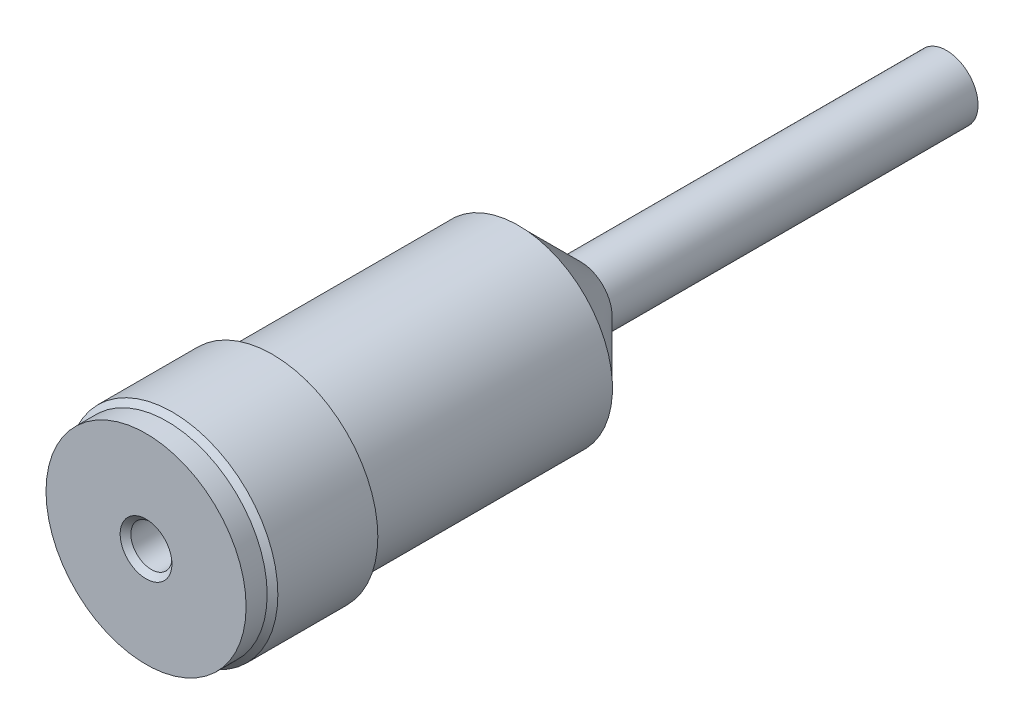
ISO-10303-21;
HEADER;
FILE_DESCRIPTION(('STEP AP214'),'2;1');
FILE_NAME('part.step','',(''),(''),'','','');
FILE_SCHEMA(('AUTOMOTIVE_DESIGN { 1 0 10303 214 1 1 1 1 }'));
ENDSEC;
DATA;
#1=APPLICATION_CONTEXT('core data for automotive mechanical design processes');
#2=APPLICATION_PROTOCOL_DEFINITION('international standard','automotive_design',2000,#1);
#3=PRODUCT_CONTEXT('',#1,'mechanical');
#4=PRODUCT('Part','Part','',(#3));
#5=PRODUCT_RELATED_PRODUCT_CATEGORY('part','',(#4));
#6=PRODUCT_DEFINITION_FORMATION('','',#4);
#7=PRODUCT_DEFINITION_CONTEXT('part definition',#1,'design');
#8=PRODUCT_DEFINITION('design','',#6,#7);
#9=PRODUCT_DEFINITION_SHAPE('','',#8);
#10=(LENGTH_UNIT() NAMED_UNIT(*) SI_UNIT(.MILLI.,.METRE.));
#11=(NAMED_UNIT(*) PLANE_ANGLE_UNIT() SI_UNIT($,.RADIAN.));
#12=(NAMED_UNIT(*) SI_UNIT($,.STERADIAN.) SOLID_ANGLE_UNIT());
#13=UNCERTAINTY_MEASURE_WITH_UNIT(LENGTH_MEASURE(1.E-05),#10,'distance_accuracy_value','');
#14=(GEOMETRIC_REPRESENTATION_CONTEXT(3) GLOBAL_UNCERTAINTY_ASSIGNED_CONTEXT((#13)) GLOBAL_UNIT_ASSIGNED_CONTEXT((#10,
#11,#12)) REPRESENTATION_CONTEXT('',''));
#15=CARTESIAN_POINT('',(0.,0.,0.));
#16=DIRECTION('',(0.,0.,1.));
#17=DIRECTION('',(1.,0.,0.));
#18=AXIS2_PLACEMENT_3D('',#15,#16,#17);
#19=CARTESIAN_POINT('',(0.,0.,-16.68));
#20=DIRECTION('',(0.,0.,-1.));
#21=DIRECTION('',(-1.,0.,0.));
#22=AXIS2_PLACEMENT_3D('',#19,#20,#21);
#23=PLANE('',#22);
#24=CARTESIAN_POINT('',(0.,0.,-16.68));
#25=DIRECTION('',(0.,0.,-1.));
#26=DIRECTION('',(-1.,0.,0.));
#27=AXIS2_PLACEMENT_3D('',#24,#25,#26);
#28=CIRCLE('',#27,4.4464);
#29=CARTESIAN_POINT('',(-4.4464,0.,-16.68));
#30=VERTEX_POINT('',#29);
#31=EDGE_CURVE('E239',#30,#30,#28,.F.);
#32=ORIENTED_EDGE('',*,*,#31,.T.);
#33=EDGE_LOOP('',(#32));
#34=FACE_BOUND('',#33,.T.);
#35=CARTESIAN_POINT('',(0.,0.,-16.68));
#36=DIRECTION('',(0.,0.,-1.));
#37=DIRECTION('',(-1.,0.,0.));
#38=AXIS2_PLACEMENT_3D('',#35,#36,#37);
#39=CIRCLE('',#38,4.463800064);
#40=CARTESIAN_POINT('',(-4.463800064,0.,-16.68));
#41=VERTEX_POINT('',#40);
#42=EDGE_CURVE('E215',#41,#41,#39,.T.);
#43=ORIENTED_EDGE('',*,*,#42,.T.);
#44=EDGE_LOOP('',(#43));
#45=FACE_BOUND('',#44,.T.);
#46=ADVANCED_FACE('F34',(#34,#45),#23,.T.);
#47=CARTESIAN_POINT('',(0.,0.,-16.68));
#48=DIRECTION('',(0.,0.,-1.));
#49=DIRECTION('',(-1.,0.,0.));
#50=AXIS2_PLACEMENT_3D('',#47,#48,#49);
#51=CYLINDRICAL_SURFACE('',#50,1.5);
#52=CARTESIAN_POINT('',(0.,0.,-19.6264));
#53=DIRECTION('',(0.,0.,-1.));
#54=DIRECTION('',(-1.,0.,0.));
#55=AXIS2_PLACEMENT_3D('',#52,#53,#54);
#56=CIRCLE('',#55,1.5);
#57=CARTESIAN_POINT('',(-1.5,0.,-19.6264));
#58=VERTEX_POINT('',#57);
#59=EDGE_CURVE('E85',#58,#58,#56,.T.);
#60=ORIENTED_EDGE('',*,*,#59,.T.);
#61=EDGE_LOOP('',(#60));
#62=FACE_BOUND('',#61,.T.);
#63=CARTESIAN_POINT('',(0.,0.,-37.));
#64=DIRECTION('',(0.,0.,-1.));
#65=DIRECTION('',(-1.,0.,0.));
#66=AXIS2_PLACEMENT_3D('',#63,#64,#65);
#67=CIRCLE('',#66,1.5);
#68=CARTESIAN_POINT('',(-1.5,0.,-37.));
#69=VERTEX_POINT('',#68);
#70=EDGE_CURVE('E138',#69,#69,#67,.T.);
#71=ORIENTED_EDGE('',*,*,#70,.F.);
#72=EDGE_LOOP('',(#71));
#73=FACE_BOUND('',#72,.T.);
#74=ADVANCED_FACE('F121',(#62,#73),#51,.T.);
#75=CARTESIAN_POINT('',(0.,0.,-37.));
#76=DIRECTION('',(0.,0.,1.));
#77=DIRECTION('',(1.,0.,0.));
#78=AXIS2_PLACEMENT_3D('',#75,#76,#77);
#79=PLANE('',#78);
#80=ORIENTED_EDGE('',*,*,#70,.T.);
#81=EDGE_LOOP('',(#80));
#82=FACE_BOUND('',#81,.T.);
#83=ADVANCED_FACE('F103',(#82),#79,.F.);
#84=CARTESIAN_POINT('',(0.,0.,-16.68));
#85=DIRECTION('',(0.,0.,-1.));
#86=DIRECTION('',(-1.,0.,0.));
#87=AXIS2_PLACEMENT_3D('',#84,#85,#86);
#88=CYLINDRICAL_SURFACE('',#87,4.463800064);
#89=CARTESIAN_POINT('',(0.,0.,-5.));
#90=DIRECTION('',(0.,0.,-1.));
#91=DIRECTION('',(-1.,0.,0.));
#92=AXIS2_PLACEMENT_3D('',#89,#90,#91);
#93=CIRCLE('',#92,4.463800064);
#94=CARTESIAN_POINT('',(-4.463800064,0.,-5.));
#95=VERTEX_POINT('',#94);
#96=EDGE_CURVE('E218',#95,#95,#93,.T.);
#97=ORIENTED_EDGE('',*,*,#96,.T.);
#98=EDGE_LOOP('',(#97));
#99=FACE_BOUND('',#98,.T.);
#100=ORIENTED_EDGE('',*,*,#42,.F.);
#101=EDGE_LOOP('',(#100));
#102=FACE_BOUND('',#101,.T.);
#103=CARTESIAN_POINT('',(-4.463800064,0.,-7.635));
#104=CARTESIAN_POINT('',(-4.46379951654484,-0.0354761223503382,-7.6349985214033));
#105=CARTESIAN_POINT('',(-4.46337269984617,-0.0709733520364018,-7.63201700203403));
#106=CARTESIAN_POINT('',(-4.4617111132848,-0.14097706824728,-7.62017189069533));
#107=CARTESIAN_POINT('',(-4.46047553800233,-0.175482531302647,-7.61130243497176));
#108=CARTESIAN_POINT('',(-4.45733539820411,-0.242479370918231,-7.58795060318941));
#109=CARTESIAN_POINT('',(-4.4554313213381,-0.274972195360446,-7.57347231779199));
#110=CARTESIAN_POINT('',(-4.45116502791023,-0.337061722521472,-7.53932347807657));
#111=CARTESIAN_POINT('',(-4.44880287987616,-0.366658857442378,-7.51965370025097));
#112=CARTESIAN_POINT('',(-4.44386483169791,-0.422331043571265,-7.47553220446888));
#113=CARTESIAN_POINT('',(-4.44128767747145,-0.44838270558471,-7.45105111146793));
#114=CARTESIAN_POINT('',(-4.43621998979742,-0.496022749874998,-7.39806509713194));
#115=CARTESIAN_POINT('',(-4.43372946114372,-0.517610885465581,-7.36955995354562));
#116=CARTESIAN_POINT('',(-4.42910480450601,-0.555800892228517,-7.30917945086535));
#117=CARTESIAN_POINT('',(-4.42697229633648,-0.57238035889492,-7.27728978636472));
#118=CARTESIAN_POINT('',(-4.42332209255423,-0.599939254966831,-7.21114313939977));
#119=CARTESIAN_POINT('',(-4.42180436682152,-0.610918958727885,-7.17688627300786));
#120=CARTESIAN_POINT('',(-4.41956780461599,-0.62689450277097,-7.10722267296102));
#121=CARTESIAN_POINT('',(-4.41884364643429,-0.631930221556787,-7.07182525833707));
#122=CARTESIAN_POINT('',(-4.4182600194334,-0.63599834394153,-7.00068096764636));
#123=CARTESIAN_POINT('',(-4.41840050588335,-0.635031058095252,-6.96493410975294));
#124=CARTESIAN_POINT('',(-4.41952542654525,-0.627153265567774,-6.89438610718649));
#125=CARTESIAN_POINT('',(-4.42050357653487,-0.620287012208786,-6.8595799063599));
#126=CARTESIAN_POINT('',(-4.42318380097652,-0.600875391526088,-6.79161874084797));
#127=CARTESIAN_POINT('',(-4.42488589401314,-0.588329878407644,-6.75846381857757));
#128=CARTESIAN_POINT('',(-4.42882922540589,-0.557869329456296,-6.69461078245339));
#129=CARTESIAN_POINT('',(-4.43107235628247,-0.539935389870494,-6.66392180813094));
#130=CARTESIAN_POINT('',(-4.43584362289435,-0.499220548596426,-6.60597207932964));
#131=CARTESIAN_POINT('',(-4.43837177547315,-0.476439360386802,-6.57871152765683));
#132=CARTESIAN_POINT('',(-4.44345605146443,-0.426433012621917,-6.5281358663786));
#133=CARTESIAN_POINT('',(-4.44601222213992,-0.399169773149106,-6.50485839628978));
#134=CARTESIAN_POINT('',(-4.45084338005667,-0.341103446424444,-6.46320383408338));
#135=CARTESIAN_POINT('',(-4.45311836628002,-0.310300346358966,-6.44482675970511));
#136=CARTESIAN_POINT('',(-4.45713286673937,-0.245997243921901,-6.41349334152117));
#137=CARTESIAN_POINT('',(-4.45887211178464,-0.212495896407413,-6.40053972163646));
#138=CARTESIAN_POINT('',(-4.46161686114841,-0.143763180044998,-6.38045270231358));
#139=CARTESIAN_POINT('',(-4.46262241003828,-0.108531916426728,-6.3733189493206));
#140=CARTESIAN_POINT('',(-4.46378060289521,-0.0376645030219416,-6.36512379820914));
#141=CARTESIAN_POINT('',(-4.4639405194999,-0.00203445551615313,-6.3640106198265));
#142=CARTESIAN_POINT('',(-4.46340917354451,0.0689037576590718,-6.36775103647221));
#143=CARTESIAN_POINT('',(-4.46271793461295,0.104211932236455,-6.37260446586445));
#144=CARTESIAN_POINT('',(-4.46056644956915,0.173348619204077,-6.38809728001881));
#145=CARTESIAN_POINT('',(-4.45910953378866,0.20718285770594,-6.39871161406683));
#146=CARTESIAN_POINT('',(-4.45558960512595,0.272591368816223,-6.42539864128144));
#147=CARTESIAN_POINT('',(-4.45352656629708,0.304165544604857,-6.44147156812176));
#148=CARTESIAN_POINT('',(-4.4490057832029,0.364386522992045,-6.47874225531139));
#149=CARTESIAN_POINT('',(-4.44654552851086,0.393012672894897,-6.49997307574905));
#150=CARTESIAN_POINT('',(-4.44151245649689,0.446314022330342,-6.54691061513902));
#151=CARTESIAN_POINT('',(-4.43893963332836,0.470989016336557,-6.57261756678014));
#152=CARTESIAN_POINT('',(-4.43394853792963,0.515874497520871,-6.62800738161543));
#153=CARTESIAN_POINT('',(-4.43153155816329,0.53605039816105,-6.65771840615733));
#154=CARTESIAN_POINT('',(-4.42714817251505,0.571125051367575,-6.72013810238252));
#155=CARTESIAN_POINT('',(-4.42518175544667,0.586023934955477,-6.75284669961455));
#156=CARTESIAN_POINT('',(-4.4219313306662,0.610067232900678,-6.82022715654207));
#157=CARTESIAN_POINT('',(-4.42064511620736,0.619230273755291,-6.8548922586664));
#158=CARTESIAN_POINT('',(-4.41889471305691,0.6316013116818,-6.92528885021152));
#159=CARTESIAN_POINT('',(-4.41843047377257,0.634809675265699,-6.96102027386238));
#160=CARTESIAN_POINT('',(-4.41837834141542,0.635172218948924,-7.03219072342624));
#161=CARTESIAN_POINT('',(-4.41878257920303,0.632380762413947,-7.0676294787236));
#162=CARTESIAN_POINT('',(-4.42040481249696,0.62093895025795,-7.13752826017107));
#163=CARTESIAN_POINT('',(-4.42162280720138,0.612288600410373,-7.17198828728558));
#164=CARTESIAN_POINT('',(-4.42473266992817,0.58939306251723,-7.23893893414625));
#165=CARTESIAN_POINT('',(-4.4266241264516,0.575151290400628,-7.27143074235978));
#166=CARTESIAN_POINT('',(-4.43086834733494,0.54148254572496,-7.33357246095951));
#167=CARTESIAN_POINT('',(-4.4332211241223,0.522055433473617,-7.36322229475409));
#168=CARTESIAN_POINT('',(-4.43814832776722,0.478368529697183,-7.41911522035266));
#169=CARTESIAN_POINT('',(-4.44072449635365,0.454068376745701,-7.44532661461027));
#170=CARTESIAN_POINT('',(-4.44579339364874,0.401410340381248,-7.49331930614323));
#171=CARTESIAN_POINT('',(-4.44828610274293,0.373051511253356,-7.51509956804515));
#172=CARTESIAN_POINT('',(-4.45292113100128,0.312917760662361,-7.55370639776029));
#173=CARTESIAN_POINT('',(-4.45506166284862,0.28112669289934,-7.57050802401363));
#174=CARTESIAN_POINT('',(-4.4587334987168,0.215159386708055,-7.59850871301093));
#175=CARTESIAN_POINT('',(-4.46026544362607,0.180985702190882,-7.6097136726891));
#176=CARTESIAN_POINT('',(-4.46219131044611,0.122208887491201,-7.62361454177174));
#177=CARTESIAN_POINT('',(-4.46279154762236,0.097971323724518,-7.6278776934831));
#178=CARTESIAN_POINT('',(-4.46359611198774,0.0491592164334789,-7.63357091987901));
#179=CARTESIAN_POINT('',(-4.46380044338216,0.0245846764912555,-7.635001024656));
#180=CARTESIAN_POINT('',(-4.463800064,0.,-7.635));
#181=B_SPLINE_CURVE_WITH_KNOTS('',3,(#103,#104,#105,#106,#107,#108,#109,#110,#111,#112,#113,
#114,#115,#116,#117,#118,#119,#120,#121,#122,#123,#124,#125,#126,#127,#128,#129,#130,#131,#132,
#133,#134,#135,#136,#137,#138,#139,#140,#141,#142,#143,#144,#145,#146,#147,#148,#149,#150,#151,
#152,#153,#154,#155,#156,#157,#158,#159,#160,#161,#162,#163,#164,#165,#166,#167,#168,#169,#170,
#171,#172,#173,#174,#175,#176,#177,#178,#179,#180),.UNSPECIFIED.,.T.,.F.,(4,2,2,2,2,2,2,2,2,2,2,
2,2,2,2,2,2,2,2,2,2,2,2,2,2,2,2,2,2,2,2,2,2,2,2,2,2,2,4),(0.,0.106338543802878,
0.212783148600933,0.319150266367894,0.425501483794065,0.532523406212009,0.639551241843479,
0.747050971643866,0.854545434081801,0.961314535687677,1.06807811382954,1.17404768964079,
1.28001998599714,1.38636848505097,1.49272327212261,1.60003339244208,1.70734390121617,
1.81470824204712,1.92206606004731,2.0284990557431,2.13492909687079,2.24090000286596,
2.34687544588019,2.45354895326439,2.56022800765892,2.66770085925619,2.77517104225351,
2.8822903924608,2.98940314922431,3.09554946910603,3.20169568438966,3.30777715315449,
3.41386148002649,3.52086372735717,3.62789094807086,3.73544561586218,3.84288671822642,
3.91657928365098,3.99027106631336),.UNSPECIFIED.);
#182=CARTESIAN_POINT('',(-4.463800064,0.,-7.635));
#183=VERTEX_POINT('',#182);
#184=EDGE_CURVE('E70',#183,#183,#181,.T.);
#185=ORIENTED_EDGE('',*,*,#184,.F.);
#186=EDGE_LOOP('',(#185));
#187=FACE_BOUND('',#186,.T.);
#188=ADVANCED_FACE('F97',(#99,#102,#187),#88,.T.);
#189=CARTESIAN_POINT('',(-5.0038,0.,-5.));
#190=DIRECTION('',(0.,0.,1.));
#191=DIRECTION('',(1.,0.,0.));
#192=AXIS2_PLACEMENT_3D('',#189,#190,#191);
#193=PLANE('',#192);
#194=ORIENTED_EDGE('',*,*,#96,.F.);
#195=EDGE_LOOP('',(#194));
#196=FACE_BOUND('',#195,.T.);
#197=CARTESIAN_POINT('',(0.,0.,-5.));
#198=DIRECTION('',(0.,0.,-1.));
#199=DIRECTION('',(-1.,0.,0.));
#200=AXIS2_PLACEMENT_3D('',#197,#198,#199);
#201=CIRCLE('',#200,5.0038);
#202=CARTESIAN_POINT('',(-5.0038,0.,-5.));
#203=VERTEX_POINT('',#202);
#204=EDGE_CURVE('E92',#203,#203,#201,.T.);
#205=ORIENTED_EDGE('',*,*,#204,.T.);
#206=EDGE_LOOP('',(#205));
#207=FACE_BOUND('',#206,.T.);
#208=ADVANCED_FACE('F102',(#196,#207),#193,.F.);
#209=CARTESIAN_POINT('',(0.,0.,0.));
#210=DIRECTION('',(0.,0.,-1.));
#211=DIRECTION('',(-1.,0.,0.));
#212=AXIS2_PLACEMENT_3D('',#209,#210,#211);
#213=CONICAL_SURFACE('',#212,4.74979999999999,0.78539816339746);
#214=CARTESIAN_POINT('',(0.,0.,-0.254000000000004));
#215=DIRECTION('',(0.,0.,1.));
#216=DIRECTION('',(1.,0.,0.));
#217=AXIS2_PLACEMENT_3D('',#214,#215,#216);
#218=CIRCLE('',#217,5.0038);
#219=CARTESIAN_POINT('',(5.0038,0.,-0.254000000000004));
#220=VERTEX_POINT('',#219);
#221=EDGE_CURVE('E82',#220,#220,#218,.F.);
#222=ORIENTED_EDGE('',*,*,#221,.F.);
#223=EDGE_LOOP('',(#222));
#224=FACE_BOUND('',#223,.T.);
#225=CARTESIAN_POINT('',(0.,0.,0.));
#226=DIRECTION('',(0.,0.,1.));
#227=DIRECTION('',(1.,0.,0.));
#228=AXIS2_PLACEMENT_3D('',#225,#226,#227);
#229=CIRCLE('',#228,4.74979999999999);
#230=CARTESIAN_POINT('',(4.74979999999999,0.,0.));
#231=VERTEX_POINT('',#230);
#232=EDGE_CURVE('E76',#231,#231,#229,.T.);
#233=ORIENTED_EDGE('',*,*,#232,.F.);
#234=EDGE_LOOP('',(#233));
#235=FACE_BOUND('',#234,.T.);
#236=ADVANCED_FACE('F108',(#224,#235),#213,.T.);
#237=CARTESIAN_POINT('',(0.,0.,-37.));
#238=DIRECTION('',(0.,0.,1.));
#239=DIRECTION('',(1.,0.,0.));
#240=AXIS2_PLACEMENT_3D('',#237,#238,#239);
#241=CYLINDRICAL_SURFACE('',#240,5.0038);
#242=ORIENTED_EDGE('',*,*,#204,.F.);
#243=EDGE_LOOP('',(#242));
#244=FACE_BOUND('',#243,.T.);
#245=ORIENTED_EDGE('',*,*,#221,.T.);
#246=EDGE_LOOP('',(#245));
#247=FACE_BOUND('',#246,.T.);
#248=ADVANCED_FACE('F117',(#244,#247),#241,.T.);
#249=CARTESIAN_POINT('',(0.,0.,-7.5));
#250=DIRECTION('',(0.,0.,1.));
#251=DIRECTION('',(1.,0.,0.));
#252=AXIS2_PLACEMENT_3D('',#249,#250,#251);
#253=CYLINDRICAL_SURFACE('',#252,0.974600032);
#254=CARTESIAN_POINT('',(0.,0.,0.746));
#255=DIRECTION('',(0.,0.,1.));
#256=DIRECTION('',(1.,0.,0.));
#257=AXIS2_PLACEMENT_3D('',#254,#255,#256);
#258=CIRCLE('',#257,0.974600032);
#259=CARTESIAN_POINT('',(0.974600032,0.,0.746));
#260=VERTEX_POINT('',#259);
#261=EDGE_CURVE('E42',#260,#260,#258,.T.);
#262=ORIENTED_EDGE('',*,*,#261,.T.);
#263=EDGE_LOOP('',(#262));
#264=FACE_BOUND('',#263,.T.);
#265=CARTESIAN_POINT('',(0.,0.,-7.5));
#266=DIRECTION('',(0.,0.,1.));
#267=DIRECTION('',(1.,0.,0.));
#268=AXIS2_PLACEMENT_3D('',#265,#266,#267);
#269=CIRCLE('',#268,0.974600032);
#270=CARTESIAN_POINT('',(-0.892535838145674,-0.391439650520998,-7.5));
#271=VERTEX_POINT('',#270);
#272=CARTESIAN_POINT('',(-0.892535838145674,0.391439650520998,-7.5));
#273=VERTEX_POINT('',#272);
#274=EDGE_CURVE('E66',#271,#273,#269,.T.);
#275=ORIENTED_EDGE('',*,*,#274,.F.);
#276=CARTESIAN_POINT('',(-0.892535838145674,-0.391439650520998,-7.5));
#277=CARTESIAN_POINT('',(-0.879737165158888,-0.420691568274923,-7.47705813443131));
#278=CARTESIAN_POINT('',(-0.866129715948107,-0.447740779023547,-7.45177579944291));
#279=CARTESIAN_POINT('',(-0.838643127566874,-0.497314900578964,-7.39661691889404));
#280=CARTESIAN_POINT('',(-0.824762674566069,-0.519782932681802,-7.36668989453977));
#281=CARTESIAN_POINT('',(-0.798418269992242,-0.559413307178756,-7.30281400928726));
#282=CARTESIAN_POINT('',(-0.785957592187958,-0.576563538181943,-7.26885620774323));
#283=CARTESIAN_POINT('',(-0.764541894556415,-0.604678261154033,-7.1975855980447));
#284=CARTESIAN_POINT('',(-0.755566417707654,-0.615679021477119,-7.16029399859878));
#285=CARTESIAN_POINT('',(-0.744955364220401,-0.628436853320045,-7.09507687477096));
#286=CARTESIAN_POINT('',(-0.741921377186814,-0.631982693131911,-7.06772641049611));
#287=CARTESIAN_POINT('',(-0.738935629313445,-0.635472795164539,-7.01262647901313));
#288=CARTESIAN_POINT('',(-0.738982415562691,-0.635418755109879,-6.98487720605879));
#289=CARTESIAN_POINT('',(-0.742149592656168,-0.631715360255042,-6.9298518560582));
#290=CARTESIAN_POINT('',(-0.745265244455282,-0.62807154889848,-6.90257511539627));
#291=CARTESIAN_POINT('',(-0.754113842329395,-0.617417610238036,-6.84911709292543));
#292=CARTESIAN_POINT('',(-0.759850172399899,-0.610403129891625,-6.82293727540104));
#293=CARTESIAN_POINT('',(-0.775395132497503,-0.59060227074818,-6.76407560748555));
#294=CARTESIAN_POINT('',(-0.785918215735507,-0.576691162793534,-6.73196275241747));
#295=CARTESIAN_POINT('',(-0.808771743116664,-0.544176727325367,-6.67091482842145));
#296=CARTESIAN_POINT('',(-0.821104700839546,-0.525566847763516,-6.64198427850305));
#297=CARTESIAN_POINT('',(-0.846425548503252,-0.483751684511148,-6.58718737116608));
#298=CARTESIAN_POINT('',(-0.859420576238801,-0.460480384329197,-6.56137473025137));
#299=CARTESIAN_POINT('',(-0.884693720769533,-0.40983347550346,-6.51371782282419));
#300=CARTESIAN_POINT('',(-0.896971826956919,-0.382457806151504,-6.49187361501981));
#301=CARTESIAN_POINT('',(-0.920659422775039,-0.321533610734376,-6.45110029201955));
#302=CARTESIAN_POINT('',(-0.93191557921094,-0.287663248859674,-6.43255607722991));
#303=CARTESIAN_POINT('',(-0.9510079570978,-0.216300901873646,-6.40171661690837));
#304=CARTESIAN_POINT('',(-0.958848955457249,-0.178814065553736,-6.38941263893573));
#305=CARTESIAN_POINT('',(-0.969278769121165,-0.107078580243017,-6.37317198841416));
#306=CARTESIAN_POINT('',(-0.972456527384236,-0.0731290363001867,-6.36829326040215));
#307=CARTESIAN_POINT('',(-0.975187066614276,-0.00475116003289337,-6.36409691051378));
#308=CARTESIAN_POINT('',(-0.974742506534253,0.0296768025803483,-6.36477520951871));
#309=CARTESIAN_POINT('',(-0.970553143441574,0.0936967736369615,-6.37122534042801));
#310=CARTESIAN_POINT('',(-0.967204119903375,0.123379894372947,-6.37638644279764));
#311=CARTESIAN_POINT('',(-0.95802754745461,0.181355919990819,-6.39071612290318));
#312=CARTESIAN_POINT('',(-0.952199631138973,0.20964861809977,-6.39988529469419));
#313=CARTESIAN_POINT('',(-0.938242231546308,0.265337449932001,-6.42228209284028));
#314=CARTESIAN_POINT('',(-0.930030497376304,0.292653288763867,-6.43565650432722));
#315=CARTESIAN_POINT('',(-0.912018080818873,0.344714678686587,-6.46586178227142));
#316=CARTESIAN_POINT('',(-0.902216937593599,0.36945948089936,-6.48269365157258));
#317=CARTESIAN_POINT('',(-0.880160252630357,0.419543848953602,-6.52212150806239));
#318=CARTESIAN_POINT('',(-0.867755638169222,0.444437217840812,-6.54520096794961));
#319=CARTESIAN_POINT('',(-0.842727027887223,0.49024451631986,-6.59499087782813));
#320=CARTESIAN_POINT('',(-0.830102664214679,0.51115089408205,-6.62170805728065));
#321=CARTESIAN_POINT('',(-0.804361287216764,0.550882643489651,-6.6818712384905));
#322=CARTESIAN_POINT('',(-0.791367497408908,0.569155702668545,-6.71574003894264));
#323=CARTESIAN_POINT('',(-0.768639656056488,0.599501022966172,-6.78712665506854));
#324=CARTESIAN_POINT('',(-0.758895268469407,0.611593012180278,-6.82463240090272));
#325=CARTESIAN_POINT('',(-0.746996220546847,0.62601908985428,-6.89011702467129));
#326=CARTESIAN_POINT('',(-0.743423354201034,0.630218757242328,-6.91742856296176));
#327=CARTESIAN_POINT('',(-0.739337210456023,0.63500928336334,-6.97258048255613));
#328=CARTESIAN_POINT('',(-0.738820470289453,0.6356042264757,-7.00042022945884));
#329=CARTESIAN_POINT('',(-0.740923292688824,0.633150787661332,-7.0557999956817));
#330=CARTESIAN_POINT('',(-0.743541590380018,0.630103875092938,-7.0833401313616));
#331=CARTESIAN_POINT('',(-0.751521862317923,0.620562410932186,-7.13741730547164));
#332=CARTESIAN_POINT('',(-0.756887415990667,0.614063361102869,-7.16395298662788));
#333=CARTESIAN_POINT('',(-0.771547743299658,0.595595730730086,-7.22293930520993));
#334=CARTESIAN_POINT('',(-0.781529117790479,0.582590929036913,-7.25489218406999));
#335=CARTESIAN_POINT('',(-0.803453069823911,0.551962883136178,-7.31579832907192));
#336=CARTESIAN_POINT('',(-0.815399686081417,0.534330082659823,-7.34474521354222));
#337=CARTESIAN_POINT('',(-0.838509597334184,0.497160254703017,-7.39616144718887));
#338=CARTESIAN_POINT('',(-0.849604228434667,0.478077685398783,-7.41899281732928));
#339=CARTESIAN_POINT('',(-0.871476798368223,0.436941959522969,-7.46171094630834));
#340=CARTESIAN_POINT('',(-0.882256084814989,0.414904778795162,-7.481612410697));
#341=CARTESIAN_POINT('',(-0.892535838145673,0.391439650520998,-7.5));
#342=B_SPLINE_CURVE_WITH_KNOTS('',3,(#276,#277,#278,#279,#280,#281,#282,#283,#284,#285,#286,
#287,#288,#289,#290,#291,#292,#293,#294,#295,#296,#297,#298,#299,#300,#301,#302,#303,#304,#305,
#306,#307,#308,#309,#310,#311,#312,#313,#314,#315,#316,#317,#318,#319,#320,#321,#322,#323,#324,
#325,#326,#327,#328,#329,#330,#331,#332,#333,#334,#335,#336,#337,#338,#339,#340,#341),
.UNSPECIFIED.,.F.,.F.,(4,2,2,2,2,2,2,2,2,2,2,2,2,2,2,2,2,2,2,2,2,2,2,2,2,2,2,2,2,2,2,2,4),(0.,
0.117809949138659,0.237003792972706,0.356467142181923,0.475218279052389,0.558084277044723,
0.640911195220434,0.723610409497318,0.806416713692421,0.915467333890377,1.02467086415541,
1.13554692271926,1.24642462142474,1.36637691667707,1.48616088712437,1.58888643088749,
1.69153657603921,1.78206915809134,1.87261516296139,1.96675899625981,2.06093017485811,
2.16892923728191,2.27713087392509,2.39834016427813,2.51916013728177,2.60238232968107,
2.68551020843983,2.76860455939491,2.85180745131677,2.95897535496312,3.06636631277222,
3.16136630364877,3.25587191095111),.UNSPECIFIED.);
#343=EDGE_CURVE('E55',#271,#273,#342,.T.);
#344=ORIENTED_EDGE('',*,*,#343,.T.);
#345=EDGE_LOOP('',(#275,#344));
#346=FACE_BOUND('',#345,.T.);
#347=ADVANCED_FACE('F111',(#264,#346),#253,.F.);
#348=CARTESIAN_POINT('',(0.,0.,-7.));
#349=DIRECTION('',(1.,0.,0.));
#350=DIRECTION('',(0.,0.,-1.));
#351=AXIS2_PLACEMENT_3D('',#348,#349,#350);
#352=PLANE('',#351);
#353=DIRECTION('',(0.,1.,0.));
#354=VECTOR('',#353,1.);
#355=CARTESIAN_POINT('',(0.,0.,-7.5));
#356=LINE('',#355,#354);
#357=CARTESIAN_POINT('',(0.,-0.391439650520998,-7.5));
#358=VERTEX_POINT('',#357);
#359=CARTESIAN_POINT('',(0.,0.391439650520998,-7.5));
#360=VERTEX_POINT('',#359);
#361=EDGE_CURVE('E61',#358,#360,#356,.T.);
#362=ORIENTED_EDGE('',*,*,#361,.T.);
#363=CARTESIAN_POINT('',(0.,0.,-7.));
#364=DIRECTION('',(1.,0.,0.));
#365=DIRECTION('',(0.,0.,-1.));
#366=AXIS2_PLACEMENT_3D('',#363,#364,#365);
#367=CIRCLE('',#366,0.635000000000001);
#368=EDGE_CURVE('E48',#358,#360,#367,.T.);
#369=ORIENTED_EDGE('',*,*,#368,.F.);
#370=EDGE_LOOP('',(#362,#369));
#371=FACE_BOUND('',#370,.T.);
#372=ADVANCED_FACE('F62',(#371),#352,.F.);
#373=CARTESIAN_POINT('',(0.,0.,-7.5));
#374=DIRECTION('',(0.,0.,1.));
#375=DIRECTION('',(1.,0.,0.));
#376=AXIS2_PLACEMENT_3D('',#373,#374,#375);
#377=PLANE('',#376);
#378=DIRECTION('',(1.,0.,0.));
#379=VECTOR('',#378,1.);
#380=CARTESIAN_POINT('',(-20.32,-0.391439650520998,-7.5));
#381=LINE('',#380,#379);
#382=EDGE_CURVE('E69',#271,#358,#381,.T.);
#383=ORIENTED_EDGE('',*,*,#382,.F.);
#384=ORIENTED_EDGE('',*,*,#274,.T.);
#385=DIRECTION('',(1.,0.,0.));
#386=VECTOR('',#385,1.);
#387=CARTESIAN_POINT('',(-20.32,0.391439650520998,-7.5));
#388=LINE('',#387,#386);
#389=EDGE_CURVE('E65',#360,#273,#388,.F.);
#390=ORIENTED_EDGE('',*,*,#389,.F.);
#391=ORIENTED_EDGE('',*,*,#361,.F.);
#392=EDGE_LOOP('',(#383,#384,#390,#391));
#393=FACE_BOUND('',#392,.T.);
#394=ADVANCED_FACE('F73',(#393),#377,.T.);
#395=CARTESIAN_POINT('',(-20.32,0.,-7.));
#396=DIRECTION('',(1.,0.,0.));
#397=DIRECTION('',(0.,0.,-1.));
#398=AXIS2_PLACEMENT_3D('',#395,#396,#397);
#399=CYLINDRICAL_SURFACE('',#398,0.635000000000001);
#400=ORIENTED_EDGE('',*,*,#184,.T.);
#401=EDGE_LOOP('',(#400));
#402=FACE_BOUND('',#401,.T.);
#403=ORIENTED_EDGE('',*,*,#382,.T.);
#404=ORIENTED_EDGE('',*,*,#368,.T.);
#405=ORIENTED_EDGE('',*,*,#389,.T.);
#406=ORIENTED_EDGE('',*,*,#343,.F.);
#407=EDGE_LOOP('',(#403,#404,#405,#406));
#408=FACE_BOUND('',#407,.T.);
#409=ADVANCED_FACE('F68',(#402,#408),#399,.F.);
#410=CARTESIAN_POINT('',(0.,0.,-19.6264));
#411=DIRECTION('',(0.,0.,1.));
#412=DIRECTION('',(1.,0.,0.));
#413=AXIS2_PLACEMENT_3D('',#410,#411,#412);
#414=CONICAL_SURFACE('',#413,1.5,0.785398163397442);
#415=ORIENTED_EDGE('',*,*,#31,.F.);
#416=EDGE_LOOP('',(#415));
#417=FACE_BOUND('',#416,.T.);
#418=ORIENTED_EDGE('',*,*,#59,.F.);
#419=EDGE_LOOP('',(#418));
#420=FACE_BOUND('',#419,.T.);
#421=ADVANCED_FACE('F193',(#417,#420),#414,.T.);
#422=CARTESIAN_POINT('',(0.,0.,1.));
#423=DIRECTION('',(0.,0.,1.));
#424=DIRECTION('',(1.,0.,0.));
#425=AXIS2_PLACEMENT_3D('',#422,#423,#424);
#426=PLANE('',#425);
#427=CARTESIAN_POINT('',(0.,0.,1.));
#428=DIRECTION('',(0.,0.,1.));
#429=DIRECTION('',(1.,0.,0.));
#430=AXIS2_PLACEMENT_3D('',#427,#428,#429);
#431=CIRCLE('',#430,1.228600032);
#432=CARTESIAN_POINT('',(1.228600032,0.,1.));
#433=VERTEX_POINT('',#432);
#434=EDGE_CURVE('E12',#433,#433,#431,.F.);
#435=ORIENTED_EDGE('',*,*,#434,.T.);
#436=EDGE_LOOP('',(#435));
#437=FACE_BOUND('',#436,.T.);
#438=CARTESIAN_POINT('',(0.,0.,1.));
#439=DIRECTION('',(0.,0.,1.));
#440=DIRECTION('',(1.,0.,0.));
#441=AXIS2_PLACEMENT_3D('',#438,#439,#440);
#442=CIRCLE('',#441,4.74979999999999);
#443=CARTESIAN_POINT('',(4.74979999999999,0.,1.));
#444=VERTEX_POINT('',#443);
#445=EDGE_CURVE('E211',#444,#444,#442,.T.);
#446=ORIENTED_EDGE('',*,*,#445,.T.);
#447=EDGE_LOOP('',(#446));
#448=FACE_BOUND('',#447,.T.);
#449=ADVANCED_FACE('F189',(#437,#448),#426,.T.);
#450=CARTESIAN_POINT('',(0.,0.,1.));
#451=DIRECTION('',(0.,0.,-1.));
#452=DIRECTION('',(-1.,0.,0.));
#453=AXIS2_PLACEMENT_3D('',#450,#451,#452);
#454=CYLINDRICAL_SURFACE('',#453,4.74979999999999);
#455=ORIENTED_EDGE('',*,*,#445,.F.);
#456=EDGE_LOOP('',(#455));
#457=FACE_BOUND('',#456,.T.);
#458=ORIENTED_EDGE('',*,*,#232,.T.);
#459=EDGE_LOOP('',(#458));
#460=FACE_BOUND('',#459,.T.);
#461=ADVANCED_FACE('F105',(#457,#460),#454,.T.);
#462=CARTESIAN_POINT('',(0.,0.,0.746));
#463=DIRECTION('',(0.,0.,1.));
#464=DIRECTION('',(1.,0.,0.));
#465=AXIS2_PLACEMENT_3D('',#462,#463,#464);
#466=CONICAL_SURFACE('',#465,0.974600032,0.785398163397453);
#467=ORIENTED_EDGE('',*,*,#434,.F.);
#468=EDGE_LOOP('',(#467));
#469=FACE_BOUND('',#468,.T.);
#470=ORIENTED_EDGE('',*,*,#261,.F.);
#471=EDGE_LOOP('',(#470));
#472=FACE_BOUND('',#471,.T.);
#473=ADVANCED_FACE('F36',(#469,#472),#466,.F.);
#474=CLOSED_SHELL('',(#46,#74,#83,#188,#208,#236,#248,#347,#372,#394,#409,#421,#449,#461,#473));
#475=MANIFOLD_SOLID_BREP('B2',#474);
#476=ADVANCED_BREP_SHAPE_REPRESENTATION('',(#18,#475),#14);
#477=SHAPE_DEFINITION_REPRESENTATION(#9,#476);
ENDSEC;
END-ISO-10303-21;
